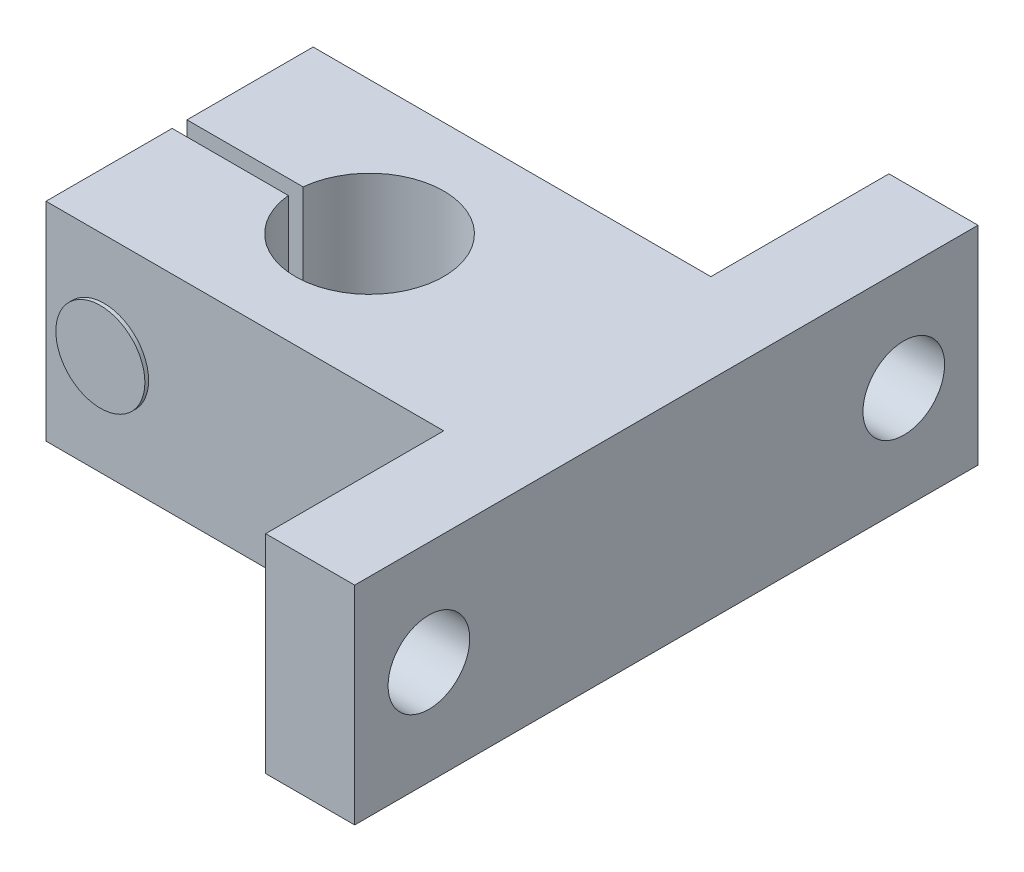
ISO-10303-21;
HEADER;
FILE_DESCRIPTION(('STEP AP214'),'2;1');
FILE_NAME('part.step','',(''),(''),'','','');
FILE_SCHEMA(('AUTOMOTIVE_DESIGN { 1 0 10303 214 1 1 1 1 }'));
ENDSEC;
DATA;
#1=APPLICATION_CONTEXT('core data for automotive mechanical design processes');
#2=APPLICATION_PROTOCOL_DEFINITION('international standard','automotive_design',2000,#1);
#3=PRODUCT_CONTEXT('',#1,'mechanical');
#4=PRODUCT('Part','Part','',(#3));
#5=PRODUCT_RELATED_PRODUCT_CATEGORY('part','',(#4));
#6=PRODUCT_DEFINITION_FORMATION('','',#4);
#7=PRODUCT_DEFINITION_CONTEXT('part definition',#1,'design');
#8=PRODUCT_DEFINITION('design','',#6,#7);
#9=PRODUCT_DEFINITION_SHAPE('','',#8);
#10=(LENGTH_UNIT() NAMED_UNIT(*) SI_UNIT(.MILLI.,.METRE.));
#11=(NAMED_UNIT(*) PLANE_ANGLE_UNIT() SI_UNIT($,.RADIAN.));
#12=(NAMED_UNIT(*) SI_UNIT($,.STERADIAN.) SOLID_ANGLE_UNIT());
#13=UNCERTAINTY_MEASURE_WITH_UNIT(LENGTH_MEASURE(1.E-05),#10,'distance_accuracy_value','');
#14=(GEOMETRIC_REPRESENTATION_CONTEXT(3) GLOBAL_UNCERTAINTY_ASSIGNED_CONTEXT((#13)) GLOBAL_UNIT_ASSIGNED_CONTEXT((#10,
#11,#12)) REPRESENTATION_CONTEXT('',''));
#15=CARTESIAN_POINT('',(0.,0.,0.));
#16=DIRECTION('',(0.,0.,1.));
#17=DIRECTION('',(1.,0.,0.));
#18=AXIS2_PLACEMENT_3D('',#15,#16,#17);
#19=CARTESIAN_POINT('',(182.2,522.,-41.5));
#20=DIRECTION('',(-1.,0.,0.));
#21=DIRECTION('',(0.,0.,1.));
#22=AXIS2_PLACEMENT_3D('',#19,#20,#21);
#23=PLANE('',#22);
#24=DIRECTION('',(0.,1.,0.));
#25=VECTOR('',#24,1.);
#26=CARTESIAN_POINT('',(182.2,522.,-32.));
#27=LINE('',#26,#25);
#28=CARTESIAN_POINT('',(182.2,522.,-32.));
#29=VERTEX_POINT('',#28);
#30=CARTESIAN_POINT('',(182.2,536.,-32.));
#31=VERTEX_POINT('',#30);
#32=EDGE_CURVE('E230',#29,#31,#27,.T.);
#33=ORIENTED_EDGE('',*,*,#32,.F.);
#34=DIRECTION('',(0.,0.,1.));
#35=VECTOR('',#34,1.);
#36=CARTESIAN_POINT('',(182.2,522.,-41.5));
#37=LINE('',#36,#35);
#38=CARTESIAN_POINT('',(182.2,522.,-23.5));
#39=VERTEX_POINT('',#38);
#40=EDGE_CURVE('E159',#29,#39,#37,.T.);
#41=ORIENTED_EDGE('',*,*,#40,.T.);
#42=DIRECTION('',(0.,1.,0.));
#43=VECTOR('',#42,1.);
#44=CARTESIAN_POINT('',(182.2,522.,-23.5));
#45=LINE('',#44,#43);
#46=CARTESIAN_POINT('',(182.2,536.,-23.5));
#47=VERTEX_POINT('',#46);
#48=EDGE_CURVE('E180',#39,#47,#45,.T.);
#49=ORIENTED_EDGE('',*,*,#48,.T.);
#50=DIRECTION('',(0.,0.,1.));
#51=VECTOR('',#50,1.);
#52=CARTESIAN_POINT('',(182.2,536.,-41.5));
#53=LINE('',#52,#51);
#54=EDGE_CURVE('E148',#31,#47,#53,.T.);
#55=ORIENTED_EDGE('',*,*,#54,.F.);
#56=EDGE_LOOP('',(#33,#41,#49,#55));
#57=FACE_BOUND('',#56,.T.);
#58=ADVANCED_FACE('F34',(#57),#23,.T.);
#59=DIRECTION('',(0.,-1.,0.));
#60=VECTOR('',#59,1.);
#61=CARTESIAN_POINT('',(182.2,522.,-33.));
#62=LINE('',#61,#60);
#63=CARTESIAN_POINT('',(182.2,536.,-33.));
#64=VERTEX_POINT('',#63);
#65=CARTESIAN_POINT('',(182.2,522.,-33.));
#66=VERTEX_POINT('',#65);
#67=EDGE_CURVE('E226',#64,#66,#62,.T.);
#68=ORIENTED_EDGE('',*,*,#67,.F.);
#69=CARTESIAN_POINT('',(182.2,536.,-41.5));
#70=VERTEX_POINT('',#69);
#71=EDGE_CURVE('E141',#70,#64,#53,.T.);
#72=ORIENTED_EDGE('',*,*,#71,.F.);
#73=DIRECTION('',(0.,1.,0.));
#74=VECTOR('',#73,1.);
#75=CARTESIAN_POINT('',(182.2,522.,-41.5));
#76=LINE('',#75,#74);
#77=CARTESIAN_POINT('',(182.2,522.,-41.5));
#78=VERTEX_POINT('',#77);
#79=EDGE_CURVE('E132',#78,#70,#76,.T.);
#80=ORIENTED_EDGE('',*,*,#79,.F.);
#81=EDGE_CURVE('E155',#78,#66,#37,.T.);
#82=ORIENTED_EDGE('',*,*,#81,.T.);
#83=EDGE_LOOP('',(#68,#72,#80,#82));
#84=FACE_BOUND('',#83,.T.);
#85=ADVANCED_FACE('F36',(#84),#23,.T.);
#86=CARTESIAN_POINT('',(182.2,522.,-41.5));
#87=DIRECTION('',(0.,0.,-1.));
#88=DIRECTION('',(-1.,0.,0.));
#89=AXIS2_PLACEMENT_3D('',#86,#87,#88);
#90=PLANE('',#89);
#91=CARTESIAN_POINT('',(186.112531407233,529.,-41.5));
#92=DIRECTION('',(0.,0.,-1.));
#93=DIRECTION('',(-1.,0.,0.));
#94=AXIS2_PLACEMENT_3D('',#91,#92,#93);
#95=CIRCLE('',#94,2.99999999999999);
#96=CARTESIAN_POINT('',(183.112531407233,529.,-41.5));
#97=VERTEX_POINT('',#96);
#98=EDGE_CURVE('E12',#97,#97,#95,.T.);
#99=ORIENTED_EDGE('',*,*,#98,.F.);
#100=EDGE_LOOP('',(#99));
#101=FACE_BOUND('',#100,.T.);
#102=DIRECTION('',(-1.,0.,0.));
#103=VECTOR('',#102,1.);
#104=CARTESIAN_POINT('',(182.2,536.,-41.5));
#105=LINE('',#104,#103);
#106=CARTESIAN_POINT('',(209.,536.,-41.5));
#107=VERTEX_POINT('',#106);
#108=EDGE_CURVE('E200',#107,#70,#105,.T.);
#109=ORIENTED_EDGE('',*,*,#108,.F.);
#110=DIRECTION('',(0.,1.,0.));
#111=VECTOR('',#110,1.);
#112=CARTESIAN_POINT('',(209.,522.,-41.5));
#113=LINE('',#112,#111);
#114=CARTESIAN_POINT('',(209.,522.,-41.5));
#115=VERTEX_POINT('',#114);
#116=EDGE_CURVE('E203',#115,#107,#113,.T.);
#117=ORIENTED_EDGE('',*,*,#116,.F.);
#118=DIRECTION('',(-1.,0.,0.));
#119=VECTOR('',#118,1.);
#120=CARTESIAN_POINT('',(182.2,522.,-41.5));
#121=LINE('',#120,#119);
#122=EDGE_CURVE('E177',#115,#78,#121,.T.);
#123=ORIENTED_EDGE('',*,*,#122,.T.);
#124=ORIENTED_EDGE('',*,*,#79,.T.);
#125=EDGE_LOOP('',(#109,#117,#123,#124));
#126=FACE_BOUND('',#125,.T.);
#127=ADVANCED_FACE('F246',(#101,#126),#90,.T.);
#128=CARTESIAN_POINT('',(209.,522.,-53.5));
#129=DIRECTION('',(-1.,0.,0.));
#130=DIRECTION('',(0.,0.,1.));
#131=AXIS2_PLACEMENT_3D('',#128,#129,#130);
#132=PLANE('',#131);
#133=CARTESIAN_POINT('',(209.,529.,-48.5));
#134=DIRECTION('',(-1.,0.,0.));
#135=DIRECTION('',(0.,0.,1.));
#136=AXIS2_PLACEMENT_3D('',#133,#134,#135);
#137=CIRCLE('',#136,2.74999999999997);
#138=CARTESIAN_POINT('',(209.,529.,-45.75));
#139=VERTEX_POINT('',#138);
#140=EDGE_CURVE('E151',#139,#139,#137,.T.);
#141=ORIENTED_EDGE('',*,*,#140,.F.);
#142=EDGE_LOOP('',(#141));
#143=FACE_BOUND('',#142,.T.);
#144=DIRECTION('',(0.,0.,1.));
#145=VECTOR('',#144,1.);
#146=CARTESIAN_POINT('',(209.,536.,-53.5));
#147=LINE('',#146,#145);
#148=CARTESIAN_POINT('',(209.,536.,-53.5));
#149=VERTEX_POINT('',#148);
#150=EDGE_CURVE('E197',#149,#107,#147,.T.);
#151=ORIENTED_EDGE('',*,*,#150,.F.);
#152=DIRECTION('',(0.,1.,0.));
#153=VECTOR('',#152,1.);
#154=CARTESIAN_POINT('',(209.,522.,-53.5));
#155=LINE('',#154,#153);
#156=CARTESIAN_POINT('',(209.,522.,-53.5));
#157=VERTEX_POINT('',#156);
#158=EDGE_CURVE('E205',#157,#149,#155,.T.);
#159=ORIENTED_EDGE('',*,*,#158,.F.);
#160=DIRECTION('',(0.,0.,1.));
#161=VECTOR('',#160,1.);
#162=CARTESIAN_POINT('',(209.,522.,-53.5));
#163=LINE('',#162,#161);
#164=EDGE_CURVE('E174',#157,#115,#163,.T.);
#165=ORIENTED_EDGE('',*,*,#164,.T.);
#166=ORIENTED_EDGE('',*,*,#116,.T.);
#167=EDGE_LOOP('',(#151,#159,#165,#166));
#168=FACE_BOUND('',#167,.T.);
#169=ADVANCED_FACE('F242',(#143,#168),#132,.T.);
#170=CARTESIAN_POINT('',(209.,522.,-53.5));
#171=DIRECTION('',(0.,0.,-1.));
#172=DIRECTION('',(-1.,0.,0.));
#173=AXIS2_PLACEMENT_3D('',#170,#171,#172);
#174=PLANE('',#173);
#175=DIRECTION('',(-1.,0.,0.));
#176=VECTOR('',#175,1.);
#177=CARTESIAN_POINT('',(209.,536.,-53.5));
#178=LINE('',#177,#176);
#179=CARTESIAN_POINT('',(215.,536.,-53.5));
#180=VERTEX_POINT('',#179);
#181=EDGE_CURVE('E194',#180,#149,#178,.T.);
#182=ORIENTED_EDGE('',*,*,#181,.F.);
#183=DIRECTION('',(0.,1.,0.));
#184=VECTOR('',#183,1.);
#185=CARTESIAN_POINT('',(215.,522.,-53.5));
#186=LINE('',#185,#184);
#187=CARTESIAN_POINT('',(215.,522.,-53.5));
#188=VERTEX_POINT('',#187);
#189=EDGE_CURVE('E207',#188,#180,#186,.T.);
#190=ORIENTED_EDGE('',*,*,#189,.F.);
#191=DIRECTION('',(-1.,0.,0.));
#192=VECTOR('',#191,1.);
#193=CARTESIAN_POINT('',(209.,522.,-53.5));
#194=LINE('',#193,#192);
#195=EDGE_CURVE('E171',#188,#157,#194,.T.);
#196=ORIENTED_EDGE('',*,*,#195,.T.);
#197=ORIENTED_EDGE('',*,*,#158,.T.);
#198=EDGE_LOOP('',(#182,#190,#196,#197));
#199=FACE_BOUND('',#198,.T.);
#200=ADVANCED_FACE('F245',(#199),#174,.T.);
#201=CARTESIAN_POINT('',(215.,522.,-53.5));
#202=DIRECTION('',(1.,0.,0.));
#203=DIRECTION('',(0.,0.,-1.));
#204=AXIS2_PLACEMENT_3D('',#201,#202,#203);
#205=PLANE('',#204);
#206=CARTESIAN_POINT('',(215.,529.,-16.5));
#207=DIRECTION('',(1.,0.,0.));
#208=DIRECTION('',(0.,0.,-1.));
#209=AXIS2_PLACEMENT_3D('',#206,#207,#208);
#210=CIRCLE('',#209,2.74999999999997);
#211=CARTESIAN_POINT('',(215.,529.,-19.25));
#212=VERTEX_POINT('',#211);
#213=EDGE_CURVE('E235',#212,#212,#210,.T.);
#214=ORIENTED_EDGE('',*,*,#213,.F.);
#215=EDGE_LOOP('',(#214));
#216=FACE_BOUND('',#215,.T.);
#217=CARTESIAN_POINT('',(215.,529.,-48.5));
#218=DIRECTION('',(1.,0.,0.));
#219=DIRECTION('',(0.,0.,-1.));
#220=AXIS2_PLACEMENT_3D('',#217,#218,#219);
#221=CIRCLE('',#220,2.74999999999997);
#222=CARTESIAN_POINT('',(215.,529.,-51.25));
#223=VERTEX_POINT('',#222);
#224=EDGE_CURVE('E146',#223,#223,#221,.T.);
#225=ORIENTED_EDGE('',*,*,#224,.F.);
#226=EDGE_LOOP('',(#225));
#227=FACE_BOUND('',#226,.T.);
#228=DIRECTION('',(0.,0.,-1.));
#229=VECTOR('',#228,1.);
#230=CARTESIAN_POINT('',(215.,536.,-53.5));
#231=LINE('',#230,#229);
#232=CARTESIAN_POINT('',(215.,536.,-11.5));
#233=VERTEX_POINT('',#232);
#234=EDGE_CURVE('E191',#233,#180,#231,.T.);
#235=ORIENTED_EDGE('',*,*,#234,.F.);
#236=DIRECTION('',(0.,1.,0.));
#237=VECTOR('',#236,1.);
#238=CARTESIAN_POINT('',(215.,522.,-11.5));
#239=LINE('',#238,#237);
#240=CARTESIAN_POINT('',(215.,522.,-11.5));
#241=VERTEX_POINT('',#240);
#242=EDGE_CURVE('E209',#241,#233,#239,.T.);
#243=ORIENTED_EDGE('',*,*,#242,.F.);
#244=DIRECTION('',(0.,0.,-1.));
#245=VECTOR('',#244,1.);
#246=CARTESIAN_POINT('',(215.,522.,-53.5));
#247=LINE('',#246,#245);
#248=EDGE_CURVE('E168',#241,#188,#247,.T.);
#249=ORIENTED_EDGE('',*,*,#248,.T.);
#250=ORIENTED_EDGE('',*,*,#189,.T.);
#251=EDGE_LOOP('',(#235,#243,#249,#250));
#252=FACE_BOUND('',#251,.T.);
#253=ADVANCED_FACE('F262',(#216,#227,#252),#205,.T.);
#254=CARTESIAN_POINT('',(209.,522.,-11.5));
#255=DIRECTION('',(0.,0.,1.));
#256=DIRECTION('',(1.,0.,0.));
#257=AXIS2_PLACEMENT_3D('',#254,#255,#256);
#258=PLANE('',#257);
#259=DIRECTION('',(1.,0.,0.));
#260=VECTOR('',#259,1.);
#261=CARTESIAN_POINT('',(209.,536.,-11.5));
#262=LINE('',#261,#260);
#263=CARTESIAN_POINT('',(209.,536.,-11.5));
#264=VERTEX_POINT('',#263);
#265=EDGE_CURVE('E188',#264,#233,#262,.T.);
#266=ORIENTED_EDGE('',*,*,#265,.F.);
#267=DIRECTION('',(0.,1.,0.));
#268=VECTOR('',#267,1.);
#269=CARTESIAN_POINT('',(209.,522.,-11.5));
#270=LINE('',#269,#268);
#271=CARTESIAN_POINT('',(209.,522.,-11.5));
#272=VERTEX_POINT('',#271);
#273=EDGE_CURVE('E211',#272,#264,#270,.T.);
#274=ORIENTED_EDGE('',*,*,#273,.F.);
#275=DIRECTION('',(1.,0.,0.));
#276=VECTOR('',#275,1.);
#277=CARTESIAN_POINT('',(209.,522.,-11.5));
#278=LINE('',#277,#276);
#279=EDGE_CURVE('E165',#272,#241,#278,.T.);
#280=ORIENTED_EDGE('',*,*,#279,.T.);
#281=ORIENTED_EDGE('',*,*,#242,.T.);
#282=EDGE_LOOP('',(#266,#274,#280,#281));
#283=FACE_BOUND('',#282,.T.);
#284=ADVANCED_FACE('F265',(#283),#258,.T.);
#285=CARTESIAN_POINT('',(209.,522.,-23.5));
#286=DIRECTION('',(-1.,0.,0.));
#287=DIRECTION('',(0.,0.,1.));
#288=AXIS2_PLACEMENT_3D('',#285,#286,#287);
#289=PLANE('',#288);
#290=CARTESIAN_POINT('',(209.,529.,-16.5));
#291=DIRECTION('',(-1.,0.,0.));
#292=DIRECTION('',(0.,0.,1.));
#293=AXIS2_PLACEMENT_3D('',#290,#291,#292);
#294=CIRCLE('',#293,2.74999999999997);
#295=CARTESIAN_POINT('',(209.,529.,-13.75));
#296=VERTEX_POINT('',#295);
#297=EDGE_CURVE('E232',#296,#296,#294,.T.);
#298=ORIENTED_EDGE('',*,*,#297,.F.);
#299=EDGE_LOOP('',(#298));
#300=FACE_BOUND('',#299,.T.);
#301=DIRECTION('',(0.,0.,1.));
#302=VECTOR('',#301,1.);
#303=CARTESIAN_POINT('',(209.,536.,-23.5));
#304=LINE('',#303,#302);
#305=CARTESIAN_POINT('',(209.,536.,-23.5));
#306=VERTEX_POINT('',#305);
#307=EDGE_CURVE('E185',#306,#264,#304,.T.);
#308=ORIENTED_EDGE('',*,*,#307,.F.);
#309=DIRECTION('',(0.,1.,0.));
#310=VECTOR('',#309,1.);
#311=CARTESIAN_POINT('',(209.,522.,-23.5));
#312=LINE('',#311,#310);
#313=CARTESIAN_POINT('',(209.,522.,-23.5));
#314=VERTEX_POINT('',#313);
#315=EDGE_CURVE('E213',#314,#306,#312,.T.);
#316=ORIENTED_EDGE('',*,*,#315,.F.);
#317=DIRECTION('',(0.,0.,1.));
#318=VECTOR('',#317,1.);
#319=CARTESIAN_POINT('',(209.,522.,-23.5));
#320=LINE('',#319,#318);
#321=EDGE_CURVE('E162',#314,#272,#320,.T.);
#322=ORIENTED_EDGE('',*,*,#321,.T.);
#323=ORIENTED_EDGE('',*,*,#273,.T.);
#324=EDGE_LOOP('',(#308,#316,#322,#323));
#325=FACE_BOUND('',#324,.T.);
#326=ADVANCED_FACE('F270',(#300,#325),#289,.T.);
#327=CARTESIAN_POINT('',(182.2,522.,-23.5));
#328=DIRECTION('',(0.,0.,1.));
#329=DIRECTION('',(1.,0.,0.));
#330=AXIS2_PLACEMENT_3D('',#327,#328,#329);
#331=PLANE('',#330);
#332=CARTESIAN_POINT('',(186.112531407233,529.,-23.5));
#333=DIRECTION('',(0.,0.,1.));
#334=DIRECTION('',(1.,0.,0.));
#335=AXIS2_PLACEMENT_3D('',#332,#333,#334);
#336=CIRCLE('',#335,2.99999999999999);
#337=CARTESIAN_POINT('',(189.112531407233,529.,-23.5));
#338=VERTEX_POINT('',#337);
#339=EDGE_CURVE('E43',#338,#338,#336,.T.);
#340=ORIENTED_EDGE('',*,*,#339,.F.);
#341=EDGE_LOOP('',(#340));
#342=FACE_BOUND('',#341,.T.);
#343=DIRECTION('',(1.,0.,0.));
#344=VECTOR('',#343,1.);
#345=CARTESIAN_POINT('',(182.2,536.,-23.5));
#346=LINE('',#345,#344);
#347=EDGE_CURVE('E182',#47,#306,#346,.T.);
#348=ORIENTED_EDGE('',*,*,#347,.F.);
#349=ORIENTED_EDGE('',*,*,#48,.F.);
#350=DIRECTION('',(1.,0.,0.));
#351=VECTOR('',#350,1.);
#352=CARTESIAN_POINT('',(182.2,522.,-23.5));
#353=LINE('',#352,#351);
#354=EDGE_CURVE('E158',#39,#314,#353,.T.);
#355=ORIENTED_EDGE('',*,*,#354,.T.);
#356=ORIENTED_EDGE('',*,*,#315,.T.);
#357=EDGE_LOOP('',(#348,#349,#355,#356));
#358=FACE_BOUND('',#357,.T.);
#359=ADVANCED_FACE('F273',(#342,#358),#331,.T.);
#360=CARTESIAN_POINT('',(0.,522.,0.));
#361=DIRECTION('',(0.,1.,0.));
#362=DIRECTION('',(0.,0.,1.));
#363=AXIS2_PLACEMENT_3D('',#360,#361,#362);
#364=PLANE('',#363);
#365=ORIENTED_EDGE('',*,*,#40,.F.);
#366=DIRECTION('',(1.,0.,0.));
#367=VECTOR('',#366,1.);
#368=CARTESIAN_POINT('',(194.333308409551,522.,-32.));
#369=LINE('',#368,#367);
#370=CARTESIAN_POINT('',(190.025062814467,522.,-32.));
#371=VERTEX_POINT('',#370);
#372=EDGE_CURVE('E224',#29,#371,#369,.T.);
#373=ORIENTED_EDGE('',*,*,#372,.T.);
#374=CARTESIAN_POINT('',(195.,522.,-32.5));
#375=DIRECTION('',(0.,1.,0.));
#376=DIRECTION('',(0.,0.,1.));
#377=AXIS2_PLACEMENT_3D('',#374,#375,#376);
#378=CIRCLE('',#377,4.99999999999999);
#379=CARTESIAN_POINT('',(190.025062814467,522.,-33.));
#380=VERTEX_POINT('',#379);
#381=EDGE_CURVE('E145',#371,#380,#378,.T.);
#382=ORIENTED_EDGE('',*,*,#381,.T.);
#383=DIRECTION('',(-1.,0.,0.));
#384=VECTOR('',#383,1.);
#385=CARTESIAN_POINT('',(194.333308409551,522.,-33.));
#386=LINE('',#385,#384);
#387=EDGE_CURVE('E59',#380,#66,#386,.T.);
#388=ORIENTED_EDGE('',*,*,#387,.T.);
#389=ORIENTED_EDGE('',*,*,#81,.F.);
#390=ORIENTED_EDGE('',*,*,#122,.F.);
#391=ORIENTED_EDGE('',*,*,#164,.F.);
#392=ORIENTED_EDGE('',*,*,#195,.F.);
#393=ORIENTED_EDGE('',*,*,#248,.F.);
#394=ORIENTED_EDGE('',*,*,#279,.F.);
#395=ORIENTED_EDGE('',*,*,#321,.F.);
#396=ORIENTED_EDGE('',*,*,#354,.F.);
#397=EDGE_LOOP('',(#365,#373,#382,#388,#389,#390,#391,#392,#393,#394,#395,#396));
#398=FACE_BOUND('',#397,.T.);
#399=ADVANCED_FACE('F258',(#398),#364,.F.);
#400=CARTESIAN_POINT('',(0.,536.,0.));
#401=DIRECTION('',(0.,1.,0.));
#402=DIRECTION('',(0.,0.,1.));
#403=AXIS2_PLACEMENT_3D('',#400,#401,#402);
#404=PLANE('',#403);
#405=DIRECTION('',(1.,0.,0.));
#406=VECTOR('',#405,1.);
#407=CARTESIAN_POINT('',(194.333308409551,536.,-32.));
#408=LINE('',#407,#406);
#409=CARTESIAN_POINT('',(190.025062814467,536.,-32.));
#410=VERTEX_POINT('',#409);
#411=EDGE_CURVE('E51',#31,#410,#408,.T.);
#412=ORIENTED_EDGE('',*,*,#411,.F.);
#413=ORIENTED_EDGE('',*,*,#54,.T.);
#414=ORIENTED_EDGE('',*,*,#347,.T.);
#415=ORIENTED_EDGE('',*,*,#307,.T.);
#416=ORIENTED_EDGE('',*,*,#265,.T.);
#417=ORIENTED_EDGE('',*,*,#234,.T.);
#418=ORIENTED_EDGE('',*,*,#181,.T.);
#419=ORIENTED_EDGE('',*,*,#150,.T.);
#420=ORIENTED_EDGE('',*,*,#108,.T.);
#421=ORIENTED_EDGE('',*,*,#71,.T.);
#422=DIRECTION('',(-1.,0.,0.));
#423=VECTOR('',#422,1.);
#424=CARTESIAN_POINT('',(194.333308409551,536.,-33.));
#425=LINE('',#424,#423);
#426=CARTESIAN_POINT('',(190.025062814467,536.,-33.));
#427=VERTEX_POINT('',#426);
#428=EDGE_CURVE('E125',#427,#64,#425,.T.);
#429=ORIENTED_EDGE('',*,*,#428,.F.);
#430=CARTESIAN_POINT('',(195.,536.,-32.5));
#431=DIRECTION('',(0.,1.,0.));
#432=DIRECTION('',(0.,0.,1.));
#433=AXIS2_PLACEMENT_3D('',#430,#431,#432);
#434=CIRCLE('',#433,4.99999999999999);
#435=EDGE_CURVE('E138',#410,#427,#434,.T.);
#436=ORIENTED_EDGE('',*,*,#435,.F.);
#437=EDGE_LOOP('',(#412,#413,#414,#415,#416,#417,#418,#419,#420,#421,#429,#436));
#438=FACE_BOUND('',#437,.T.);
#439=ADVANCED_FACE('F137',(#438),#404,.T.);
#440=CARTESIAN_POINT('',(195.,522.,-32.5));
#441=DIRECTION('',(0.,1.,0.));
#442=DIRECTION('',(0.,0.,1.));
#443=AXIS2_PLACEMENT_3D('',#440,#441,#442);
#444=CYLINDRICAL_SURFACE('',#443,4.99999999999999);
#445=ORIENTED_EDGE('',*,*,#381,.F.);
#446=DIRECTION('',(0.,1.,0.));
#447=VECTOR('',#446,1.);
#448=CARTESIAN_POINT('',(190.025062814467,522.,-32.));
#449=LINE('',#448,#447);
#450=EDGE_CURVE('E131',#371,#410,#449,.T.);
#451=ORIENTED_EDGE('',*,*,#450,.T.);
#452=ORIENTED_EDGE('',*,*,#435,.T.);
#453=DIRECTION('',(0.,1.,0.));
#454=VECTOR('',#453,1.);
#455=CARTESIAN_POINT('',(190.025062814467,522.,-33.));
#456=LINE('',#455,#454);
#457=EDGE_CURVE('E122',#427,#380,#456,.F.);
#458=ORIENTED_EDGE('',*,*,#457,.T.);
#459=EDGE_LOOP('',(#445,#451,#452,#458));
#460=FACE_BOUND('',#459,.T.);
#461=ADVANCED_FACE('F144',(#460),#444,.F.);
#462=CARTESIAN_POINT('',(220.,529.,-48.5));
#463=DIRECTION('',(-1.,0.,0.));
#464=DIRECTION('',(0.,0.,1.));
#465=AXIS2_PLACEMENT_3D('',#462,#463,#464);
#466=CYLINDRICAL_SURFACE('',#465,2.74999999999997);
#467=ORIENTED_EDGE('',*,*,#224,.T.);
#468=EDGE_LOOP('',(#467));
#469=FACE_BOUND('',#468,.T.);
#470=ORIENTED_EDGE('',*,*,#140,.T.);
#471=EDGE_LOOP('',(#470));
#472=FACE_BOUND('',#471,.T.);
#473=ADVANCED_FACE('F240',(#469,#472),#466,.F.);
#474=CARTESIAN_POINT('',(220.,529.,-16.5));
#475=DIRECTION('',(-1.,0.,0.));
#476=DIRECTION('',(0.,0.,1.));
#477=AXIS2_PLACEMENT_3D('',#474,#475,#476);
#478=CYLINDRICAL_SURFACE('',#477,2.74999999999997);
#479=ORIENTED_EDGE('',*,*,#213,.T.);
#480=EDGE_LOOP('',(#479));
#481=FACE_BOUND('',#480,.T.);
#482=ORIENTED_EDGE('',*,*,#297,.T.);
#483=EDGE_LOOP('',(#482));
#484=FACE_BOUND('',#483,.T.);
#485=ADVANCED_FACE('F292',(#481,#484),#478,.F.);
#486=CARTESIAN_POINT('',(194.333308409551,522.,-33.));
#487=DIRECTION('',(0.,0.,-1.));
#488=DIRECTION('',(-1.,0.,0.));
#489=AXIS2_PLACEMENT_3D('',#486,#487,#488);
#490=PLANE('',#489);
#491=CARTESIAN_POINT('',(186.112531407233,529.,-33.));
#492=DIRECTION('',(0.,0.,-1.));
#493=DIRECTION('',(-1.,0.,0.));
#494=AXIS2_PLACEMENT_3D('',#491,#492,#493);
#495=CIRCLE('',#494,2.99999999999999);
#496=CARTESIAN_POINT('',(189.112531407233,529.,-33.));
#497=VERTEX_POINT('',#496);
#498=EDGE_CURVE('E142',#497,#497,#495,.T.);
#499=ORIENTED_EDGE('',*,*,#498,.T.);
#500=EDGE_LOOP('',(#499));
#501=FACE_BOUND('',#500,.T.);
#502=ORIENTED_EDGE('',*,*,#67,.T.);
#503=ORIENTED_EDGE('',*,*,#387,.F.);
#504=ORIENTED_EDGE('',*,*,#457,.F.);
#505=ORIENTED_EDGE('',*,*,#428,.T.);
#506=EDGE_LOOP('',(#502,#503,#504,#505));
#507=FACE_BOUND('',#506,.T.);
#508=ADVANCED_FACE('F124',(#501,#507),#490,.F.);
#509=CARTESIAN_POINT('',(194.333308409551,522.,-32.));
#510=DIRECTION('',(0.,0.,1.));
#511=DIRECTION('',(1.,0.,0.));
#512=AXIS2_PLACEMENT_3D('',#509,#510,#511);
#513=PLANE('',#512);
#514=CARTESIAN_POINT('',(186.112531407233,529.,-32.));
#515=DIRECTION('',(0.,0.,1.));
#516=DIRECTION('',(1.,0.,0.));
#517=AXIS2_PLACEMENT_3D('',#514,#515,#516);
#518=CIRCLE('',#517,2.99999999999999);
#519=CARTESIAN_POINT('',(189.112531407233,529.,-32.));
#520=VERTEX_POINT('',#519);
#521=EDGE_CURVE('E38',#520,#520,#518,.T.);
#522=ORIENTED_EDGE('',*,*,#521,.T.);
#523=EDGE_LOOP('',(#522));
#524=FACE_BOUND('',#523,.T.);
#525=ORIENTED_EDGE('',*,*,#32,.T.);
#526=ORIENTED_EDGE('',*,*,#411,.T.);
#527=ORIENTED_EDGE('',*,*,#450,.F.);
#528=ORIENTED_EDGE('',*,*,#372,.F.);
#529=EDGE_LOOP('',(#525,#526,#527,#528));
#530=FACE_BOUND('',#529,.T.);
#531=ADVANCED_FACE('F278',(#524,#530),#513,.F.);
#532=CARTESIAN_POINT('',(186.112531407233,529.,-50.4852813742386));
#533=DIRECTION('',(0.,0.,1.));
#534=DIRECTION('',(1.,0.,0.));
#535=AXIS2_PLACEMENT_3D('',#532,#533,#534);
#536=CYLINDRICAL_SURFACE('',#535,2.99999999999999);
#537=CARTESIAN_POINT('',(189.112531407233,529.,-32.));
#538=CARTESIAN_POINT('',(189.112531407233,529.,-32.0104166666667));
#539=CARTESIAN_POINT('',(189.112531407233,529.,-32.0208333333333));
#540=CARTESIAN_POINT('',(189.112531407233,529.,-32.0416666666667));
#541=CARTESIAN_POINT('',(189.112531407233,529.,-32.0520833333333));
#542=CARTESIAN_POINT('',(189.112531407233,529.,-32.0729166666667));
#543=CARTESIAN_POINT('',(189.112531407233,529.,-32.0833333333333));
#544=CARTESIAN_POINT('',(189.112531407233,529.,-32.1041666666667));
#545=CARTESIAN_POINT('',(189.112531407233,529.,-32.1145833333333));
#546=CARTESIAN_POINT('',(189.112531407233,529.,-32.1354166666667));
#547=CARTESIAN_POINT('',(189.112531407233,529.,-32.1458333333333));
#548=CARTESIAN_POINT('',(189.112531407233,529.,-32.1666666666667));
#549=CARTESIAN_POINT('',(189.112531407233,529.,-32.1770833333333));
#550=CARTESIAN_POINT('',(189.112531407233,529.,-32.1979166666667));
#551=CARTESIAN_POINT('',(189.112531407233,529.,-32.2083333333333));
#552=CARTESIAN_POINT('',(189.112531407233,529.,-32.2291666666667));
#553=CARTESIAN_POINT('',(189.112531407233,529.,-32.2395833333333));
#554=CARTESIAN_POINT('',(189.112531407233,529.,-32.2604166666667));
#555=CARTESIAN_POINT('',(189.112531407233,529.,-32.2708333333333));
#556=CARTESIAN_POINT('',(189.112531407233,529.,-32.2916666666667));
#557=CARTESIAN_POINT('',(189.112531407233,529.,-32.3020833333333));
#558=CARTESIAN_POINT('',(189.112531407233,529.,-32.3229166666667));
#559=CARTESIAN_POINT('',(189.112531407233,529.,-32.3333333333333));
#560=CARTESIAN_POINT('',(189.112531407233,529.,-32.3541666666667));
#561=CARTESIAN_POINT('',(189.112531407233,529.,-32.3645833333333));
#562=CARTESIAN_POINT('',(189.112531407233,529.,-32.3854166666667));
#563=CARTESIAN_POINT('',(189.112531407233,529.,-32.3958333333333));
#564=CARTESIAN_POINT('',(189.112531407233,529.,-32.4166666666667));
#565=CARTESIAN_POINT('',(189.112531407233,529.,-32.4270833333333));
#566=CARTESIAN_POINT('',(189.112531407233,529.,-32.4479166666667));
#567=CARTESIAN_POINT('',(189.112531407233,529.,-32.4583333333333));
#568=CARTESIAN_POINT('',(189.112531407233,529.,-32.4791666666667));
#569=CARTESIAN_POINT('',(189.112531407233,529.,-32.4895833333333));
#570=CARTESIAN_POINT('',(189.112531407233,529.,-32.5104166666667));
#571=CARTESIAN_POINT('',(189.112531407233,529.,-32.5208333333333));
#572=CARTESIAN_POINT('',(189.112531407233,529.,-32.5416666666667));
#573=CARTESIAN_POINT('',(189.112531407233,529.,-32.5520833333333));
#574=CARTESIAN_POINT('',(189.112531407233,529.,-32.5729166666667));
#575=CARTESIAN_POINT('',(189.112531407233,529.,-32.5833333333333));
#576=CARTESIAN_POINT('',(189.112531407233,529.,-32.6041666666667));
#577=CARTESIAN_POINT('',(189.112531407233,529.,-32.6145833333333));
#578=CARTESIAN_POINT('',(189.112531407233,529.,-32.6354166666667));
#579=CARTESIAN_POINT('',(189.112531407233,529.,-32.6458333333333));
#580=CARTESIAN_POINT('',(189.112531407233,529.,-32.6666666666667));
#581=CARTESIAN_POINT('',(189.112531407233,529.,-32.6770833333333));
#582=CARTESIAN_POINT('',(189.112531407233,529.,-32.6979166666667));
#583=CARTESIAN_POINT('',(189.112531407233,529.,-32.7083333333333));
#584=CARTESIAN_POINT('',(189.112531407233,529.,-32.7291666666667));
#585=CARTESIAN_POINT('',(189.112531407233,529.,-32.7395833333333));
#586=CARTESIAN_POINT('',(189.112531407233,529.,-32.7604166666667));
#587=CARTESIAN_POINT('',(189.112531407233,529.,-32.7708333333333));
#588=CARTESIAN_POINT('',(189.112531407233,529.,-32.7916666666667));
#589=CARTESIAN_POINT('',(189.112531407233,529.,-32.8020833333333));
#590=CARTESIAN_POINT('',(189.112531407233,529.,-32.8229166666667));
#591=CARTESIAN_POINT('',(189.112531407233,529.,-32.8333333333333));
#592=CARTESIAN_POINT('',(189.112531407233,529.,-32.8541666666667));
#593=CARTESIAN_POINT('',(189.112531407233,529.,-32.8645833333333));
#594=CARTESIAN_POINT('',(189.112531407233,529.,-32.8854166666667));
#595=CARTESIAN_POINT('',(189.112531407233,529.,-32.8958333333333));
#596=CARTESIAN_POINT('',(189.112531407233,529.,-32.9166666666667));
#597=CARTESIAN_POINT('',(189.112531407233,529.,-32.9270833333333));
#598=CARTESIAN_POINT('',(189.112531407233,529.,-32.9479166666667));
#599=CARTESIAN_POINT('',(189.112531407233,529.,-32.9583333333333));
#600=CARTESIAN_POINT('',(189.112531407233,529.,-32.9791666666667));
#601=CARTESIAN_POINT('',(189.112531407233,529.,-32.9895833333333));
#602=CARTESIAN_POINT('',(189.112531407233,529.,-33.));
#603=B_SPLINE_CURVE_WITH_KNOTS('',3,(#537,#538,#539,#540,#541,#542,#543,#544,#545,#546,#547,
#548,#549,#550,#551,#552,#553,#554,#555,#556,#557,#558,#559,#560,#561,#562,#563,#564,#565,#566,
#567,#568,#569,#570,#571,#572,#573,#574,#575,#576,#577,#578,#579,#580,#581,#582,#583,#584,#585,
#586,#587,#588,#589,#590,#591,#592,#593,#594,#595,#596,#597,#598,#599,#600,#601,#602),
.UNSPECIFIED.,.F.,.F.,(4,2,2,2,2,2,2,2,2,2,2,2,2,2,2,2,2,2,2,2,2,2,2,2,2,2,2,2,2,2,2,2,4),(0.,
0.0312500000000035,0.0625000000000001,0.0937499999999966,0.125,0.156250000000004,0.1875,
0.218749999999997,0.25,0.281250000000004,0.3125,0.343749999999997,0.375,0.406250000000004,
0.4375,0.468749999999997,0.5,0.531250000000004,0.5625,0.593749999999997,0.625000000000001,
0.656250000000004,0.687500000000001,0.718749999999997,0.750000000000001,0.781250000000004,
0.812500000000001,0.843749999999997,0.875000000000001,0.906250000000004,0.937500000000001,
0.968749999999997,1.),.UNSPECIFIED.);
#604=EDGE_CURVE('BSEAM280',#520,#497,#603,.T.);
#605=ORIENTED_EDGE('',*,*,#521,.F.);
#606=ORIENTED_EDGE('',*,*,#498,.F.);
#607=ORIENTED_EDGE('',*,*,#604,.T.);
#608=ORIENTED_EDGE('',*,*,#604,.F.);
#609=EDGE_LOOP('',(#605,#607,#606,#608));
#610=FACE_BOUND('',#609,.T.);
#611=ADVANCED_FACE('F280',(#610),#536,.T.);
#612=CARTESIAN_POINT('',(186.112531407233,529.,-23.25));
#613=DIRECTION('',(0.,0.,1.));
#614=DIRECTION('',(1.,0.,0.));
#615=AXIS2_PLACEMENT_3D('',#612,#613,#614);
#616=PLANE('',#615);
#617=CARTESIAN_POINT('',(186.112531407233,529.,-23.25));
#618=DIRECTION('',(0.,0.,1.));
#619=DIRECTION('',(1.,0.,0.));
#620=AXIS2_PLACEMENT_3D('',#617,#618,#619);
#621=CIRCLE('',#620,2.99999999999999);
#622=CARTESIAN_POINT('',(189.112531407233,529.,-23.25));
#623=VERTEX_POINT('',#622);
#624=EDGE_CURVE('E408',#623,#623,#621,.T.);
#625=ORIENTED_EDGE('',*,*,#624,.T.);
#626=EDGE_LOOP('',(#625));
#627=FACE_BOUND('',#626,.T.);
#628=ADVANCED_FACE('F287',(#627),#616,.T.);
#629=ORIENTED_EDGE('',*,*,#339,.T.);
#630=EDGE_LOOP('',(#629));
#631=FACE_BOUND('',#630,.T.);
#632=ORIENTED_EDGE('',*,*,#624,.F.);
#633=EDGE_LOOP('',(#632));
#634=FACE_BOUND('',#633,.T.);
#635=ADVANCED_FACE('F291',(#631,#634),#536,.T.);
#636=ORIENTED_EDGE('',*,*,#98,.T.);
#637=EDGE_LOOP('',(#636));
#638=FACE_BOUND('',#637,.T.);
#639=CARTESIAN_POINT('',(186.112531407233,529.,-41.75));
#640=DIRECTION('',(0.,0.,-1.));
#641=DIRECTION('',(-1.,0.,0.));
#642=AXIS2_PLACEMENT_3D('',#639,#640,#641);
#643=CIRCLE('',#642,2.99999999999999);
#644=CARTESIAN_POINT('',(183.112531407233,529.,-41.75));
#645=VERTEX_POINT('',#644);
#646=EDGE_CURVE('E406',#645,#645,#643,.F.);
#647=ORIENTED_EDGE('',*,*,#646,.T.);
#648=EDGE_LOOP('',(#647));
#649=FACE_BOUND('',#648,.T.);
#650=ADVANCED_FACE('F290',(#638,#649),#536,.T.);
#651=CARTESIAN_POINT('',(182.2,522.,-41.75));
#652=DIRECTION('',(0.,0.,-1.));
#653=DIRECTION('',(-1.,0.,0.));
#654=AXIS2_PLACEMENT_3D('',#651,#652,#653);
#655=PLANE('',#654);
#656=ORIENTED_EDGE('',*,*,#646,.F.);
#657=EDGE_LOOP('',(#656));
#658=FACE_BOUND('',#657,.T.);
#659=ADVANCED_FACE('F392',(#658),#655,.T.);
#660=CLOSED_SHELL('',(#58,#85,#127,#169,#200,#253,#284,#326,#359,#399,#439,#461,#473,#485,#508,
#531,#611,#628,#635,#650,#659));
#661=MANIFOLD_SOLID_BREP('B2',#660);
#662=ADVANCED_BREP_SHAPE_REPRESENTATION('',(#18,#661),#14);
#663=SHAPE_DEFINITION_REPRESENTATION(#9,#662);
ENDSEC;
END-ISO-10303-21;
